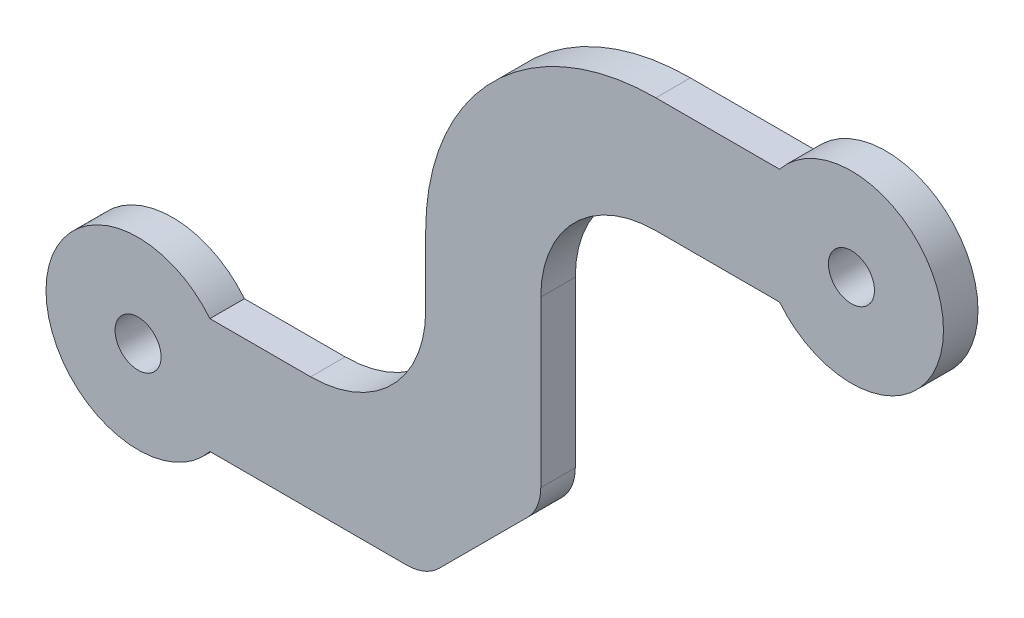
ISO-10303-21;
HEADER;
FILE_DESCRIPTION(('STEP AP214'),'2;1');
FILE_NAME('part.step','',(''),(''),'','','');
FILE_SCHEMA(('AUTOMOTIVE_DESIGN { 1 0 10303 214 1 1 1 1 }'));
ENDSEC;
DATA;
#1=APPLICATION_CONTEXT('core data for automotive mechanical design processes');
#2=APPLICATION_PROTOCOL_DEFINITION('international standard','automotive_design',2000,#1);
#3=PRODUCT_CONTEXT('',#1,'mechanical');
#4=PRODUCT('Part','Part','',(#3));
#5=PRODUCT_RELATED_PRODUCT_CATEGORY('part','',(#4));
#6=PRODUCT_DEFINITION_FORMATION('','',#4);
#7=PRODUCT_DEFINITION_CONTEXT('part definition',#1,'design');
#8=PRODUCT_DEFINITION('design','',#6,#7);
#9=PRODUCT_DEFINITION_SHAPE('','',#8);
#10=(LENGTH_UNIT() NAMED_UNIT(*) SI_UNIT(.MILLI.,.METRE.));
#11=(NAMED_UNIT(*) PLANE_ANGLE_UNIT() SI_UNIT($,.RADIAN.));
#12=(NAMED_UNIT(*) SI_UNIT($,.STERADIAN.) SOLID_ANGLE_UNIT());
#13=UNCERTAINTY_MEASURE_WITH_UNIT(LENGTH_MEASURE(1.E-05),#10,'distance_accuracy_value','');
#14=(GEOMETRIC_REPRESENTATION_CONTEXT(3) GLOBAL_UNCERTAINTY_ASSIGNED_CONTEXT((#13)) GLOBAL_UNIT_ASSIGNED_CONTEXT((#10,
#11,#12)) REPRESENTATION_CONTEXT('',''));
#15=CARTESIAN_POINT('',(0.,0.,0.));
#16=DIRECTION('',(0.,0.,1.));
#17=DIRECTION('',(1.,0.,0.));
#18=AXIS2_PLACEMENT_3D('',#15,#16,#17);
#19=CARTESIAN_POINT('',(0.,0.,1.5));
#20=DIRECTION('',(0.,0.,1.));
#21=DIRECTION('',(1.,0.,0.));
#22=AXIS2_PLACEMENT_3D('',#19,#20,#21);
#23=PLANE('',#22);
#24=CARTESIAN_POINT('',(0.,0.,1.5));
#25=DIRECTION('',(0.,0.,1.));
#26=DIRECTION('',(1.,0.,0.));
#27=AXIS2_PLACEMENT_3D('',#24,#25,#26);
#28=CIRCLE('',#27,1.);
#29=CARTESIAN_POINT('',(1.,0.,1.5));
#30=VERTEX_POINT('',#29);
#31=EDGE_CURVE('E270',#30,#30,#28,.T.);
#32=ORIENTED_EDGE('',*,*,#31,.F.);
#33=EDGE_LOOP('',(#32));
#34=FACE_BOUND('',#33,.T.);
#35=DIRECTION('',(-0.707106781186549,-0.707106781186547,0.));
#36=VECTOR('',#35,1.);
#37=CARTESIAN_POINT('',(7.49999999999997,-7.5,1.5));
#38=LINE('',#37,#36);
#39=CARTESIAN_POINT('',(13.0857864376269,-1.9142135623731,1.5));
#40=VERTEX_POINT('',#39);
#41=CARTESIAN_POINT('',(16.9142135623731,1.9142135623731,1.5));
#42=VERTEX_POINT('',#41);
#43=EDGE_CURVE('E224',#40,#42,#38,.F.);
#44=ORIENTED_EDGE('',*,*,#43,.T.);
#45=CARTESIAN_POINT('',(15.5,3.3284271247462,1.5));
#46=DIRECTION('',(0.,0.,1.));
#47=DIRECTION('',(1.,0.,0.));
#48=AXIS2_PLACEMENT_3D('',#45,#46,#47);
#49=CIRCLE('',#48,2.);
#50=CARTESIAN_POINT('',(17.5,3.3284271247462,1.5));
#51=VERTEX_POINT('',#50);
#52=EDGE_CURVE('E50',#42,#51,#49,.T.);
#53=ORIENTED_EDGE('',*,*,#52,.T.);
#54=DIRECTION('',(0.,1.,0.));
#55=VECTOR('',#54,1.);
#56=CARTESIAN_POINT('',(17.5,-2.5,1.5));
#57=LINE('',#56,#55);
#58=CARTESIAN_POINT('',(17.5,10.5,1.5));
#59=VERTEX_POINT('',#58);
#60=EDGE_CURVE('E154',#51,#59,#57,.T.);
#61=ORIENTED_EDGE('',*,*,#60,.T.);
#62=CARTESIAN_POINT('',(22.5,10.5,1.5));
#63=DIRECTION('',(0.,0.,1.));
#64=DIRECTION('',(1.,0.,0.));
#65=AXIS2_PLACEMENT_3D('',#62,#63,#64);
#66=CIRCLE('',#65,5.);
#67=CARTESIAN_POINT('',(22.5,15.5,1.5));
#68=VERTEX_POINT('',#67);
#69=EDGE_CURVE('E204',#59,#68,#66,.F.);
#70=ORIENTED_EDGE('',*,*,#69,.T.);
#71=DIRECTION('',(1.,0.,0.));
#72=VECTOR('',#71,1.);
#73=CARTESIAN_POINT('',(27.8775010008008,15.5,1.5));
#74=LINE('',#73,#72);
#75=CARTESIAN_POINT('',(27.8775010008008,15.5,1.5));
#76=VERTEX_POINT('',#75);
#77=EDGE_CURVE('E254',#68,#76,#74,.T.);
#78=ORIENTED_EDGE('',*,*,#77,.T.);
#79=CARTESIAN_POINT('',(31.,18.,1.5));
#80=DIRECTION('',(0.,0.,1.));
#81=DIRECTION('',(1.,0.,0.));
#82=AXIS2_PLACEMENT_3D('',#79,#80,#81);
#83=CIRCLE('',#82,4.);
#84=CARTESIAN_POINT('',(27.8775010008008,20.5,1.5));
#85=VERTEX_POINT('',#84);
#86=EDGE_CURVE('E321',#76,#85,#83,.T.);
#87=ORIENTED_EDGE('',*,*,#86,.T.);
#88=DIRECTION('',(-1.,0.,0.));
#89=VECTOR('',#88,1.);
#90=CARTESIAN_POINT('',(27.8775010008008,20.5,1.5));
#91=LINE('',#90,#89);
#92=CARTESIAN_POINT('',(22.5,20.5,1.5));
#93=VERTEX_POINT('',#92);
#94=EDGE_CURVE('E300',#85,#93,#91,.T.);
#95=ORIENTED_EDGE('',*,*,#94,.T.);
#96=CARTESIAN_POINT('',(22.5,10.5,1.5));
#97=DIRECTION('',(0.,0.,1.));
#98=DIRECTION('',(1.,0.,0.));
#99=AXIS2_PLACEMENT_3D('',#96,#97,#98);
#100=CIRCLE('',#99,10.);
#101=CARTESIAN_POINT('',(12.5,10.5,1.5));
#102=VERTEX_POINT('',#101);
#103=EDGE_CURVE('E189',#93,#102,#100,.T.);
#104=ORIENTED_EDGE('',*,*,#103,.T.);
#105=DIRECTION('',(0.,-1.,0.));
#106=VECTOR('',#105,1.);
#107=CARTESIAN_POINT('',(12.5,2.5,1.5));
#108=LINE('',#107,#106);
#109=CARTESIAN_POINT('',(12.5,7.5,1.5));
#110=VERTEX_POINT('',#109);
#111=EDGE_CURVE('E315',#102,#110,#108,.T.);
#112=ORIENTED_EDGE('',*,*,#111,.T.);
#113=CARTESIAN_POINT('',(7.5,7.5,1.5));
#114=DIRECTION('',(0.,0.,1.));
#115=DIRECTION('',(1.,0.,0.));
#116=AXIS2_PLACEMENT_3D('',#113,#114,#115);
#117=CIRCLE('',#116,5.);
#118=CARTESIAN_POINT('',(7.5,2.5,1.5));
#119=VERTEX_POINT('',#118);
#120=EDGE_CURVE('E217',#110,#119,#117,.F.);
#121=ORIENTED_EDGE('',*,*,#120,.T.);
#122=DIRECTION('',(-1.,0.,0.));
#123=VECTOR('',#122,1.);
#124=CARTESIAN_POINT('',(3.1224989991992,2.5,1.5));
#125=LINE('',#124,#123);
#126=CARTESIAN_POINT('',(3.1224989991992,2.5,1.5));
#127=VERTEX_POINT('',#126);
#128=EDGE_CURVE('E160',#119,#127,#125,.T.);
#129=ORIENTED_EDGE('',*,*,#128,.T.);
#130=CARTESIAN_POINT('',(0.,0.,1.5));
#131=DIRECTION('',(0.,0.,1.));
#132=DIRECTION('',(1.,0.,0.));
#133=AXIS2_PLACEMENT_3D('',#130,#131,#132);
#134=CIRCLE('',#133,4.);
#135=CARTESIAN_POINT('',(3.1224989991992,-2.5,1.5));
#136=VERTEX_POINT('',#135);
#137=EDGE_CURVE('E155',#127,#136,#134,.T.);
#138=ORIENTED_EDGE('',*,*,#137,.T.);
#139=DIRECTION('',(1.,0.,0.));
#140=VECTOR('',#139,1.);
#141=CARTESIAN_POINT('',(3.1224989991992,-2.5,1.5));
#142=LINE('',#141,#140);
#143=CARTESIAN_POINT('',(11.6715728752538,-2.5,1.5));
#144=VERTEX_POINT('',#143);
#145=EDGE_CURVE('E145',#136,#144,#142,.T.);
#146=ORIENTED_EDGE('',*,*,#145,.T.);
#147=CARTESIAN_POINT('',(11.6715728752538,-0.5,1.5));
#148=DIRECTION('',(0.,0.,1.));
#149=DIRECTION('',(1.,0.,0.));
#150=AXIS2_PLACEMENT_3D('',#147,#148,#149);
#151=CIRCLE('',#150,2.);
#152=EDGE_CURVE('E57',#144,#40,#151,.T.);
#153=ORIENTED_EDGE('',*,*,#152,.T.);
#154=EDGE_LOOP('',(#44,#53,#61,#70,#78,#87,#95,#104,#112,#121,#129,#138,#146,#153));
#155=FACE_BOUND('',#154,.T.);
#156=CARTESIAN_POINT('',(31.,18.,1.5));
#157=DIRECTION('',(0.,0.,1.));
#158=DIRECTION('',(1.,0.,0.));
#159=AXIS2_PLACEMENT_3D('',#156,#157,#158);
#160=CIRCLE('',#159,0.999999999999995);
#161=CARTESIAN_POINT('',(32.,18.,1.5));
#162=VERTEX_POINT('',#161);
#163=EDGE_CURVE('E332',#162,#162,#160,.T.);
#164=ORIENTED_EDGE('',*,*,#163,.F.);
#165=EDGE_LOOP('',(#164));
#166=FACE_BOUND('',#165,.T.);
#167=ADVANCED_FACE('F41',(#34,#155,#166),#23,.T.);
#168=CARTESIAN_POINT('',(0.,0.,0.));
#169=DIRECTION('',(0.,0.,1.));
#170=DIRECTION('',(1.,0.,0.));
#171=AXIS2_PLACEMENT_3D('',#168,#169,#170);
#172=PLANE('',#171);
#173=DIRECTION('',(0.,1.,0.));
#174=VECTOR('',#173,1.);
#175=CARTESIAN_POINT('',(17.5,-2.5,0.));
#176=LINE('',#175,#174);
#177=CARTESIAN_POINT('',(17.5,3.3284271247462,0.));
#178=VERTEX_POINT('',#177);
#179=CARTESIAN_POINT('',(17.5,10.5,0.));
#180=VERTEX_POINT('',#179);
#181=EDGE_CURVE('E261',#178,#180,#176,.T.);
#182=ORIENTED_EDGE('',*,*,#181,.F.);
#183=CARTESIAN_POINT('',(15.5,3.3284271247462,0.));
#184=DIRECTION('',(0.,0.,1.));
#185=DIRECTION('',(1.,0.,0.));
#186=AXIS2_PLACEMENT_3D('',#183,#184,#185);
#187=CIRCLE('',#186,2.);
#188=CARTESIAN_POINT('',(16.9142135623731,1.9142135623731,0.));
#189=VERTEX_POINT('',#188);
#190=EDGE_CURVE('E234',#178,#189,#187,.F.);
#191=ORIENTED_EDGE('',*,*,#190,.T.);
#192=DIRECTION('',(0.707106781186549,0.707106781186547,0.));
#193=VECTOR('',#192,1.);
#194=CARTESIAN_POINT('',(17.5,2.5,0.));
#195=LINE('',#194,#193);
#196=CARTESIAN_POINT('',(13.0857864376269,-1.9142135623731,0.));
#197=VERTEX_POINT('',#196);
#198=EDGE_CURVE('E220',#189,#197,#195,.F.);
#199=ORIENTED_EDGE('',*,*,#198,.T.);
#200=CARTESIAN_POINT('',(11.6715728752538,-0.5,0.));
#201=DIRECTION('',(0.,0.,1.));
#202=DIRECTION('',(1.,0.,0.));
#203=AXIS2_PLACEMENT_3D('',#200,#201,#202);
#204=CIRCLE('',#203,2.);
#205=CARTESIAN_POINT('',(11.6715728752538,-2.5,0.));
#206=VERTEX_POINT('',#205);
#207=EDGE_CURVE('E231',#197,#206,#204,.F.);
#208=ORIENTED_EDGE('',*,*,#207,.T.);
#209=DIRECTION('',(1.,0.,0.));
#210=VECTOR('',#209,1.);
#211=CARTESIAN_POINT('',(3.1224989991992,-2.5,0.));
#212=LINE('',#211,#210);
#213=CARTESIAN_POINT('',(3.1224989991992,-2.5,0.));
#214=VERTEX_POINT('',#213);
#215=EDGE_CURVE('E263',#214,#206,#212,.T.);
#216=ORIENTED_EDGE('',*,*,#215,.F.);
#217=CARTESIAN_POINT('',(0.,0.,0.));
#218=DIRECTION('',(0.,0.,1.));
#219=DIRECTION('',(1.,0.,0.));
#220=AXIS2_PLACEMENT_3D('',#217,#218,#219);
#221=CIRCLE('',#220,4.);
#222=CARTESIAN_POINT('',(3.1224989991992,2.5,0.));
#223=VERTEX_POINT('',#222);
#224=EDGE_CURVE('E169',#223,#214,#221,.T.);
#225=ORIENTED_EDGE('',*,*,#224,.F.);
#226=DIRECTION('',(-1.,0.,0.));
#227=VECTOR('',#226,1.);
#228=CARTESIAN_POINT('',(3.1224989991992,2.5,0.));
#229=LINE('',#228,#227);
#230=CARTESIAN_POINT('',(7.5,2.5,0.));
#231=VERTEX_POINT('',#230);
#232=EDGE_CURVE('E165',#231,#223,#229,.T.);
#233=ORIENTED_EDGE('',*,*,#232,.F.);
#234=CARTESIAN_POINT('',(7.5,7.5,0.));
#235=DIRECTION('',(0.,0.,1.));
#236=DIRECTION('',(1.,0.,0.));
#237=AXIS2_PLACEMENT_3D('',#234,#235,#236);
#238=CIRCLE('',#237,5.);
#239=CARTESIAN_POINT('',(12.5,7.5,0.));
#240=VERTEX_POINT('',#239);
#241=EDGE_CURVE('E214',#231,#240,#238,.T.);
#242=ORIENTED_EDGE('',*,*,#241,.T.);
#243=DIRECTION('',(0.,-1.,0.));
#244=VECTOR('',#243,1.);
#245=CARTESIAN_POINT('',(12.5,2.5,0.));
#246=LINE('',#245,#244);
#247=CARTESIAN_POINT('',(12.5,10.5,0.));
#248=VERTEX_POINT('',#247);
#249=EDGE_CURVE('E283',#248,#240,#246,.T.);
#250=ORIENTED_EDGE('',*,*,#249,.F.);
#251=CARTESIAN_POINT('',(22.5,10.5,0.));
#252=DIRECTION('',(0.,0.,1.));
#253=DIRECTION('',(1.,0.,0.));
#254=AXIS2_PLACEMENT_3D('',#251,#252,#253);
#255=CIRCLE('',#254,10.);
#256=CARTESIAN_POINT('',(22.5,20.5,0.));
#257=VERTEX_POINT('',#256);
#258=EDGE_CURVE('E177',#248,#257,#255,.F.);
#259=ORIENTED_EDGE('',*,*,#258,.T.);
#260=DIRECTION('',(-1.,0.,0.));
#261=VECTOR('',#260,1.);
#262=CARTESIAN_POINT('',(27.8775010008008,20.5,0.));
#263=LINE('',#262,#261);
#264=CARTESIAN_POINT('',(27.8775010008008,20.5,0.));
#265=VERTEX_POINT('',#264);
#266=EDGE_CURVE('E279',#265,#257,#263,.T.);
#267=ORIENTED_EDGE('',*,*,#266,.F.);
#268=CARTESIAN_POINT('',(31.,18.,0.));
#269=DIRECTION('',(0.,0.,1.));
#270=DIRECTION('',(1.,0.,0.));
#271=AXIS2_PLACEMENT_3D('',#268,#269,#270);
#272=CIRCLE('',#271,4.);
#273=CARTESIAN_POINT('',(27.8775010008008,15.5,0.));
#274=VERTEX_POINT('',#273);
#275=EDGE_CURVE('E276',#274,#265,#272,.T.);
#276=ORIENTED_EDGE('',*,*,#275,.F.);
#277=DIRECTION('',(1.,0.,0.));
#278=VECTOR('',#277,1.);
#279=CARTESIAN_POINT('',(27.8775010008008,15.5,0.));
#280=LINE('',#279,#278);
#281=CARTESIAN_POINT('',(22.5,15.5,0.));
#282=VERTEX_POINT('',#281);
#283=EDGE_CURVE('E268',#282,#274,#280,.T.);
#284=ORIENTED_EDGE('',*,*,#283,.F.);
#285=CARTESIAN_POINT('',(22.5,10.5,0.));
#286=DIRECTION('',(0.,0.,1.));
#287=DIRECTION('',(1.,0.,0.));
#288=AXIS2_PLACEMENT_3D('',#285,#286,#287);
#289=CIRCLE('',#288,5.);
#290=EDGE_CURVE('E200',#282,#180,#289,.T.);
#291=ORIENTED_EDGE('',*,*,#290,.T.);
#292=EDGE_LOOP('',(#182,#191,#199,#208,#216,#225,#233,#242,#250,#259,#267,#276,#284,#291));
#293=FACE_BOUND('',#292,.T.);
#294=CARTESIAN_POINT('',(0.,0.,0.));
#295=DIRECTION('',(0.,0.,1.));
#296=DIRECTION('',(1.,0.,0.));
#297=AXIS2_PLACEMENT_3D('',#294,#295,#296);
#298=CIRCLE('',#297,1.);
#299=CARTESIAN_POINT('',(1.,0.,0.));
#300=VERTEX_POINT('',#299);
#301=EDGE_CURVE('E328',#300,#300,#298,.T.);
#302=ORIENTED_EDGE('',*,*,#301,.T.);
#303=EDGE_LOOP('',(#302));
#304=FACE_BOUND('',#303,.T.);
#305=CARTESIAN_POINT('',(31.,18.,0.));
#306=DIRECTION('',(0.,0.,1.));
#307=DIRECTION('',(1.,0.,0.));
#308=AXIS2_PLACEMENT_3D('',#305,#306,#307);
#309=CIRCLE('',#308,0.999999999999995);
#310=CARTESIAN_POINT('',(32.,18.,0.));
#311=VERTEX_POINT('',#310);
#312=EDGE_CURVE('E336',#311,#311,#309,.T.);
#313=ORIENTED_EDGE('',*,*,#312,.T.);
#314=EDGE_LOOP('',(#313));
#315=FACE_BOUND('',#314,.T.);
#316=ADVANCED_FACE('F258',(#293,#304,#315),#172,.F.);
#317=CARTESIAN_POINT('',(0.,0.,1.5));
#318=DIRECTION('',(0.,0.,-1.));
#319=DIRECTION('',(-1.,0.,0.));
#320=AXIS2_PLACEMENT_3D('',#317,#318,#319);
#321=CYLINDRICAL_SURFACE('',#320,4.);
#322=ORIENTED_EDGE('',*,*,#224,.T.);
#323=DIRECTION('',(0.,0.,-1.));
#324=VECTOR('',#323,1.);
#325=CARTESIAN_POINT('',(3.1224989991992,-2.5,1.5));
#326=LINE('',#325,#324);
#327=EDGE_CURVE('E150',#136,#214,#326,.T.);
#328=ORIENTED_EDGE('',*,*,#327,.F.);
#329=ORIENTED_EDGE('',*,*,#137,.F.);
#330=DIRECTION('',(0.,0.,-1.));
#331=VECTOR('',#330,1.);
#332=CARTESIAN_POINT('',(3.1224989991992,2.5,1.5));
#333=LINE('',#332,#331);
#334=EDGE_CURVE('E289',#127,#223,#333,.T.);
#335=ORIENTED_EDGE('',*,*,#334,.T.);
#336=EDGE_LOOP('',(#322,#328,#329,#335));
#337=FACE_BOUND('',#336,.T.);
#338=ADVANCED_FACE('F167',(#337),#321,.T.);
#339=CARTESIAN_POINT('',(3.1224989991992,-2.5,1.5));
#340=DIRECTION('',(0.,1.,0.));
#341=DIRECTION('',(-1.,0.,0.));
#342=AXIS2_PLACEMENT_3D('',#339,#340,#341);
#343=PLANE('',#342);
#344=ORIENTED_EDGE('',*,*,#215,.T.);
#345=DIRECTION('',(0.,0.,-1.));
#346=VECTOR('',#345,1.);
#347=CARTESIAN_POINT('',(11.6715728752538,-2.5,1.5));
#348=LINE('',#347,#346);
#349=EDGE_CURVE('E11',#206,#144,#348,.F.);
#350=ORIENTED_EDGE('',*,*,#349,.T.);
#351=ORIENTED_EDGE('',*,*,#145,.F.);
#352=ORIENTED_EDGE('',*,*,#327,.T.);
#353=EDGE_LOOP('',(#344,#350,#351,#352));
#354=FACE_BOUND('',#353,.T.);
#355=ADVANCED_FACE('F148',(#354),#343,.F.);
#356=CARTESIAN_POINT('',(17.5,-2.5,1.5));
#357=DIRECTION('',(-1.,0.,0.));
#358=DIRECTION('',(0.,0.,1.));
#359=AXIS2_PLACEMENT_3D('',#356,#357,#358);
#360=PLANE('',#359);
#361=ORIENTED_EDGE('',*,*,#60,.F.);
#362=DIRECTION('',(0.,0.,1.));
#363=VECTOR('',#362,1.);
#364=CARTESIAN_POINT('',(17.5,3.3284271247462,0.));
#365=LINE('',#364,#363);
#366=EDGE_CURVE('E227',#51,#178,#365,.F.);
#367=ORIENTED_EDGE('',*,*,#366,.T.);
#368=ORIENTED_EDGE('',*,*,#181,.T.);
#369=DIRECTION('',(0.,0.,-1.));
#370=VECTOR('',#369,1.);
#371=CARTESIAN_POINT('',(17.5,10.5,1.5));
#372=LINE('',#371,#370);
#373=EDGE_CURVE('E196',#180,#59,#372,.F.);
#374=ORIENTED_EDGE('',*,*,#373,.T.);
#375=EDGE_LOOP('',(#361,#367,#368,#374));
#376=FACE_BOUND('',#375,.T.);
#377=ADVANCED_FACE('F249',(#376),#360,.F.);
#378=CARTESIAN_POINT('',(27.8775010008008,15.5,1.5));
#379=DIRECTION('',(0.,1.,0.));
#380=DIRECTION('',(-1.,0.,0.));
#381=AXIS2_PLACEMENT_3D('',#378,#379,#380);
#382=PLANE('',#381);
#383=ORIENTED_EDGE('',*,*,#77,.F.);
#384=DIRECTION('',(0.,0.,-1.));
#385=VECTOR('',#384,1.);
#386=CARTESIAN_POINT('',(22.5,15.5,0.));
#387=LINE('',#386,#385);
#388=EDGE_CURVE('E192',#68,#282,#387,.T.);
#389=ORIENTED_EDGE('',*,*,#388,.T.);
#390=ORIENTED_EDGE('',*,*,#283,.T.);
#391=DIRECTION('',(0.,0.,-1.));
#392=VECTOR('',#391,1.);
#393=CARTESIAN_POINT('',(27.8775010008008,15.5,1.5));
#394=LINE('',#393,#392);
#395=EDGE_CURVE('E172',#76,#274,#394,.T.);
#396=ORIENTED_EDGE('',*,*,#395,.F.);
#397=EDGE_LOOP('',(#383,#389,#390,#396));
#398=FACE_BOUND('',#397,.T.);
#399=ADVANCED_FACE('F369',(#398),#382,.F.);
#400=CARTESIAN_POINT('',(31.,18.,1.5));
#401=DIRECTION('',(0.,0.,-1.));
#402=DIRECTION('',(-1.,0.,0.));
#403=AXIS2_PLACEMENT_3D('',#400,#401,#402);
#404=CYLINDRICAL_SURFACE('',#403,4.);
#405=ORIENTED_EDGE('',*,*,#275,.T.);
#406=DIRECTION('',(0.,0.,-1.));
#407=VECTOR('',#406,1.);
#408=CARTESIAN_POINT('',(27.8775010008008,20.5,1.5));
#409=LINE('',#408,#407);
#410=EDGE_CURVE('E180',#85,#265,#409,.T.);
#411=ORIENTED_EDGE('',*,*,#410,.F.);
#412=ORIENTED_EDGE('',*,*,#86,.F.);
#413=ORIENTED_EDGE('',*,*,#395,.T.);
#414=EDGE_LOOP('',(#405,#411,#412,#413));
#415=FACE_BOUND('',#414,.T.);
#416=ADVANCED_FACE('F366',(#415),#404,.T.);
#417=CARTESIAN_POINT('',(27.8775010008008,20.5,1.5));
#418=DIRECTION('',(0.,-1.,0.));
#419=DIRECTION('',(1.,0.,0.));
#420=AXIS2_PLACEMENT_3D('',#417,#418,#419);
#421=PLANE('',#420);
#422=ORIENTED_EDGE('',*,*,#266,.T.);
#423=DIRECTION('',(0.,0.,-1.));
#424=VECTOR('',#423,1.);
#425=CARTESIAN_POINT('',(22.5,20.5,1.5));
#426=LINE('',#425,#424);
#427=EDGE_CURVE('E186',#257,#93,#426,.F.);
#428=ORIENTED_EDGE('',*,*,#427,.T.);
#429=ORIENTED_EDGE('',*,*,#94,.F.);
#430=ORIENTED_EDGE('',*,*,#410,.T.);
#431=EDGE_LOOP('',(#422,#428,#429,#430));
#432=FACE_BOUND('',#431,.T.);
#433=ADVANCED_FACE('F297',(#432),#421,.F.);
#434=CARTESIAN_POINT('',(12.5,2.5,1.5));
#435=DIRECTION('',(1.,0.,0.));
#436=DIRECTION('',(0.,1.,0.));
#437=AXIS2_PLACEMENT_3D('',#434,#435,#436);
#438=PLANE('',#437);
#439=ORIENTED_EDGE('',*,*,#249,.T.);
#440=DIRECTION('',(0.,0.,-1.));
#441=VECTOR('',#440,1.);
#442=CARTESIAN_POINT('',(12.5,7.5,1.5));
#443=LINE('',#442,#441);
#444=EDGE_CURVE('E211',#240,#110,#443,.F.);
#445=ORIENTED_EDGE('',*,*,#444,.T.);
#446=ORIENTED_EDGE('',*,*,#111,.F.);
#447=DIRECTION('',(0.,0.,-1.));
#448=VECTOR('',#447,1.);
#449=CARTESIAN_POINT('',(12.5,10.5,1.5));
#450=LINE('',#449,#448);
#451=EDGE_CURVE('E171',#102,#248,#450,.T.);
#452=ORIENTED_EDGE('',*,*,#451,.T.);
#453=EDGE_LOOP('',(#439,#445,#446,#452));
#454=FACE_BOUND('',#453,.T.);
#455=ADVANCED_FACE('F312',(#454),#438,.F.);
#456=CARTESIAN_POINT('',(3.1224989991992,2.5,1.5));
#457=DIRECTION('',(0.,-1.,0.));
#458=DIRECTION('',(1.,0.,0.));
#459=AXIS2_PLACEMENT_3D('',#456,#457,#458);
#460=PLANE('',#459);
#461=ORIENTED_EDGE('',*,*,#128,.F.);
#462=DIRECTION('',(0.,0.,-1.));
#463=VECTOR('',#462,1.);
#464=CARTESIAN_POINT('',(7.5,2.5,0.));
#465=LINE('',#464,#463);
#466=EDGE_CURVE('E207',#119,#231,#465,.T.);
#467=ORIENTED_EDGE('',*,*,#466,.T.);
#468=ORIENTED_EDGE('',*,*,#232,.T.);
#469=ORIENTED_EDGE('',*,*,#334,.F.);
#470=EDGE_LOOP('',(#461,#467,#468,#469));
#471=FACE_BOUND('',#470,.T.);
#472=ADVANCED_FACE('F358',(#471),#460,.F.);
#473=CARTESIAN_POINT('',(0.,0.,1.5));
#474=DIRECTION('',(0.,0.,-1.));
#475=DIRECTION('',(-1.,0.,0.));
#476=AXIS2_PLACEMENT_3D('',#473,#474,#475);
#477=CYLINDRICAL_SURFACE('',#476,1.);
#478=ORIENTED_EDGE('',*,*,#31,.T.);
#479=EDGE_LOOP('',(#478));
#480=FACE_BOUND('',#479,.T.);
#481=ORIENTED_EDGE('',*,*,#301,.F.);
#482=EDGE_LOOP('',(#481));
#483=FACE_BOUND('',#482,.T.);
#484=ADVANCED_FACE('F355',(#480,#483),#477,.F.);
#485=CARTESIAN_POINT('',(31.,18.,1.5));
#486=DIRECTION('',(0.,0.,-1.));
#487=DIRECTION('',(-1.,0.,0.));
#488=AXIS2_PLACEMENT_3D('',#485,#486,#487);
#489=CYLINDRICAL_SURFACE('',#488,0.999999999999995);
#490=ORIENTED_EDGE('',*,*,#163,.T.);
#491=EDGE_LOOP('',(#490));
#492=FACE_BOUND('',#491,.T.);
#493=ORIENTED_EDGE('',*,*,#312,.F.);
#494=EDGE_LOOP('',(#493));
#495=FACE_BOUND('',#494,.T.);
#496=ADVANCED_FACE('F344',(#492,#495),#489,.F.);
#497=CARTESIAN_POINT('',(22.5,10.5,1.5));
#498=DIRECTION('',(0.,0.,-1.));
#499=DIRECTION('',(-1.,0.,0.));
#500=AXIS2_PLACEMENT_3D('',#497,#498,#499);
#501=CYLINDRICAL_SURFACE('',#500,10.);
#502=ORIENTED_EDGE('',*,*,#103,.F.);
#503=ORIENTED_EDGE('',*,*,#427,.F.);
#504=ORIENTED_EDGE('',*,*,#258,.F.);
#505=ORIENTED_EDGE('',*,*,#451,.F.);
#506=EDGE_LOOP('',(#502,#503,#504,#505));
#507=FACE_BOUND('',#506,.T.);
#508=ADVANCED_FACE('F309',(#507),#501,.T.);
#509=CARTESIAN_POINT('',(22.5,10.5,1.5));
#510=DIRECTION('',(0.,0.,1.));
#511=DIRECTION('',(1.,0.,0.));
#512=AXIS2_PLACEMENT_3D('',#509,#510,#511);
#513=CYLINDRICAL_SURFACE('',#512,5.);
#514=ORIENTED_EDGE('',*,*,#69,.F.);
#515=ORIENTED_EDGE('',*,*,#373,.F.);
#516=ORIENTED_EDGE('',*,*,#290,.F.);
#517=ORIENTED_EDGE('',*,*,#388,.F.);
#518=EDGE_LOOP('',(#514,#515,#516,#517));
#519=FACE_BOUND('',#518,.T.);
#520=ADVANCED_FACE('F381',(#519),#513,.F.);
#521=CARTESIAN_POINT('',(7.5,7.5,1.5));
#522=DIRECTION('',(0.,0.,1.));
#523=DIRECTION('',(1.,0.,0.));
#524=AXIS2_PLACEMENT_3D('',#521,#522,#523);
#525=CYLINDRICAL_SURFACE('',#524,5.);
#526=ORIENTED_EDGE('',*,*,#120,.F.);
#527=ORIENTED_EDGE('',*,*,#444,.F.);
#528=ORIENTED_EDGE('',*,*,#241,.F.);
#529=ORIENTED_EDGE('',*,*,#466,.F.);
#530=EDGE_LOOP('',(#526,#527,#528,#529));
#531=FACE_BOUND('',#530,.T.);
#532=ADVANCED_FACE('F384',(#531),#525,.F.);
#533=CARTESIAN_POINT('',(17.5,2.5,1.5));
#534=DIRECTION('',(-0.707106781186547,0.707106781186549,0.));
#535=DIRECTION('',(0.,0.,-1.));
#536=AXIS2_PLACEMENT_3D('',#533,#534,#535);
#537=PLANE('',#536);
#538=ORIENTED_EDGE('',*,*,#198,.F.);
#539=DIRECTION('',(0.,0.,-1.));
#540=VECTOR('',#539,1.);
#541=CARTESIAN_POINT('',(16.9142135623731,1.9142135623731,1.5));
#542=LINE('',#541,#540);
#543=EDGE_CURVE('E64',#189,#42,#542,.F.);
#544=ORIENTED_EDGE('',*,*,#543,.T.);
#545=ORIENTED_EDGE('',*,*,#43,.F.);
#546=DIRECTION('',(0.,0.,1.));
#547=VECTOR('',#546,1.);
#548=CARTESIAN_POINT('',(13.0857864376269,-1.9142135623731,0.));
#549=LINE('',#548,#547);
#550=EDGE_CURVE('E237',#40,#197,#549,.F.);
#551=ORIENTED_EDGE('',*,*,#550,.T.);
#552=EDGE_LOOP('',(#538,#544,#545,#551));
#553=FACE_BOUND('',#552,.T.);
#554=ADVANCED_FACE('F262',(#553),#537,.F.);
#555=CARTESIAN_POINT('',(15.5,3.3284271247462,1.5));
#556=DIRECTION('',(0.,0.,-1.));
#557=DIRECTION('',(-1.,0.,0.));
#558=AXIS2_PLACEMENT_3D('',#555,#556,#557);
#559=CYLINDRICAL_SURFACE('',#558,2.);
#560=ORIENTED_EDGE('',*,*,#52,.F.);
#561=ORIENTED_EDGE('',*,*,#543,.F.);
#562=ORIENTED_EDGE('',*,*,#190,.F.);
#563=ORIENTED_EDGE('',*,*,#366,.F.);
#564=EDGE_LOOP('',(#560,#561,#562,#563));
#565=FACE_BOUND('',#564,.T.);
#566=ADVANCED_FACE('F256',(#565),#559,.T.);
#567=CARTESIAN_POINT('',(11.6715728752538,-0.5,1.5));
#568=DIRECTION('',(0.,0.,1.));
#569=DIRECTION('',(1.,0.,0.));
#570=AXIS2_PLACEMENT_3D('',#567,#568,#569);
#571=CYLINDRICAL_SURFACE('',#570,2.);
#572=ORIENTED_EDGE('',*,*,#207,.F.);
#573=ORIENTED_EDGE('',*,*,#550,.F.);
#574=ORIENTED_EDGE('',*,*,#152,.F.);
#575=ORIENTED_EDGE('',*,*,#349,.F.);
#576=EDGE_LOOP('',(#572,#573,#574,#575));
#577=FACE_BOUND('',#576,.T.);
#578=ADVANCED_FACE('F43',(#577),#571,.T.);
#579=CLOSED_SHELL('',(#167,#316,#338,#355,#377,#399,#416,#433,#455,#472,#484,#496,#508,#520,
#532,#554,#566,#578));
#580=MANIFOLD_SOLID_BREP('B2',#579);
#581=ADVANCED_BREP_SHAPE_REPRESENTATION('',(#18,#580),#14);
#582=SHAPE_DEFINITION_REPRESENTATION(#9,#581);
ENDSEC;
END-ISO-10303-21;
